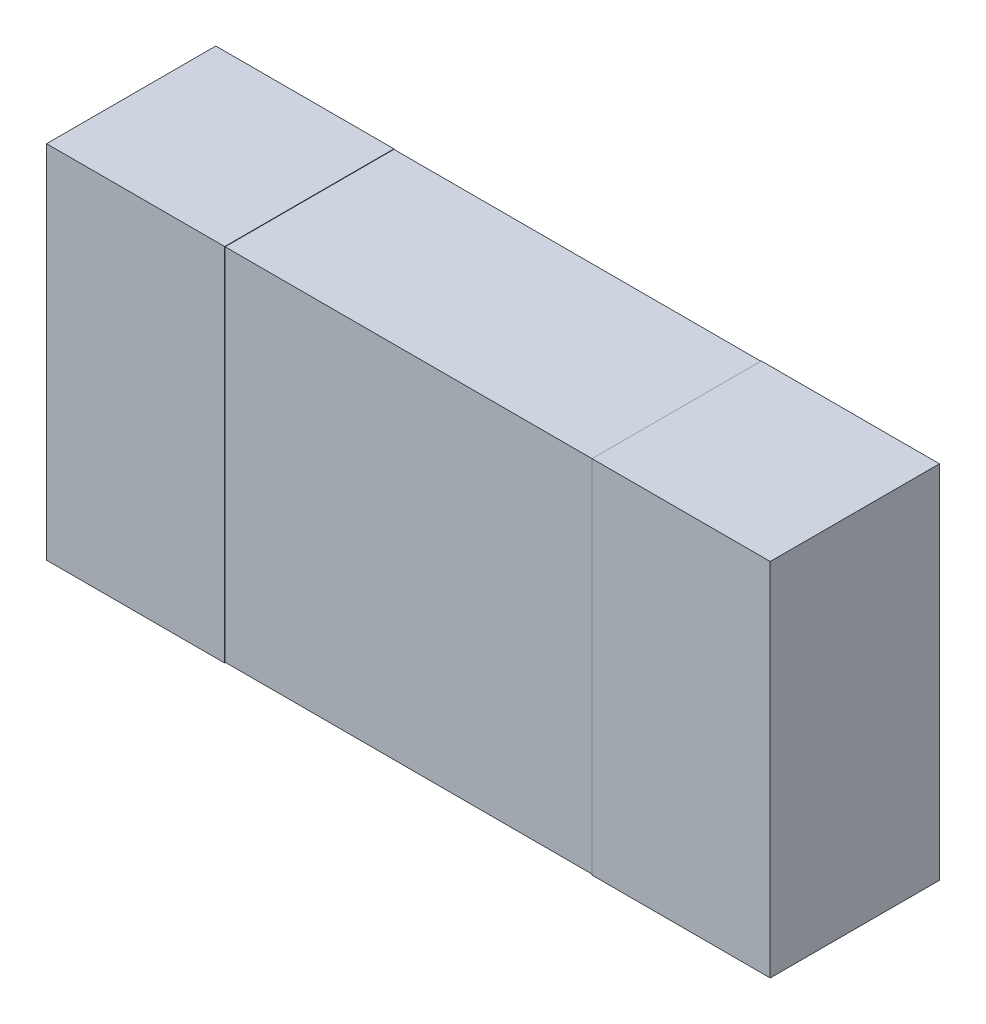
ISO-10303-21;
HEADER;
FILE_DESCRIPTION(('STEP AP214'),'2;1');
FILE_NAME('part.step','',(''),(''),'','','');
FILE_SCHEMA(('AUTOMOTIVE_DESIGN { 1 0 10303 214 1 1 1 1 }'));
ENDSEC;
DATA;
#1=APPLICATION_CONTEXT('core data for automotive mechanical design processes');
#2=APPLICATION_PROTOCOL_DEFINITION('international standard','automotive_design',2000,#1);
#3=PRODUCT_CONTEXT('',#1,'mechanical');
#4=PRODUCT('Part','Part','',(#3));
#5=PRODUCT_RELATED_PRODUCT_CATEGORY('part','',(#4));
#6=PRODUCT_DEFINITION_FORMATION('','',#4);
#7=PRODUCT_DEFINITION_CONTEXT('part definition',#1,'design');
#8=PRODUCT_DEFINITION('design','',#6,#7);
#9=PRODUCT_DEFINITION_SHAPE('','',#8);
#10=(LENGTH_UNIT() NAMED_UNIT(*) SI_UNIT(.MILLI.,.METRE.));
#11=(NAMED_UNIT(*) PLANE_ANGLE_UNIT() SI_UNIT($,.RADIAN.));
#12=(NAMED_UNIT(*) SI_UNIT($,.STERADIAN.) SOLID_ANGLE_UNIT());
#13=UNCERTAINTY_MEASURE_WITH_UNIT(LENGTH_MEASURE(1.E-05),#10,'distance_accuracy_value','');
#14=(GEOMETRIC_REPRESENTATION_CONTEXT(3) GLOBAL_UNCERTAINTY_ASSIGNED_CONTEXT((#13)) GLOBAL_UNIT_ASSIGNED_CONTEXT((#10,
#11,#12)) REPRESENTATION_CONTEXT('',''));
#15=CARTESIAN_POINT('',(0.,0.,0.));
#16=DIRECTION('',(0.,0.,1.));
#17=DIRECTION('',(1.,0.,0.));
#18=AXIS2_PLACEMENT_3D('',#15,#16,#17);
#19=CARTESIAN_POINT('',(0.,0.,0.38));
#20=DIRECTION('',(0.,0.,1.));
#21=DIRECTION('',(1.,0.,0.));
#22=AXIS2_PLACEMENT_3D('',#19,#20,#21);
#23=PLANE('',#22);
#24=DIRECTION('',(0.,-1.,0.));
#25=VECTOR('',#24,1.);
#26=CARTESIAN_POINT('',(0.8125,0.405,0.38));
#27=LINE('',#26,#25);
#28=CARTESIAN_POINT('',(0.8125,-0.405,0.38));
#29=VERTEX_POINT('',#28);
#30=CARTESIAN_POINT('',(0.8125,0.405,0.38));
#31=VERTEX_POINT('',#30);
#32=EDGE_CURVE('E223',#29,#31,#27,.F.);
#33=ORIENTED_EDGE('',*,*,#32,.T.);
#34=DIRECTION('',(1.,0.,0.));
#35=VECTOR('',#34,1.);
#36=CARTESIAN_POINT('',(-0.8125,0.405,0.38));
#37=LINE('',#36,#35);
#38=CARTESIAN_POINT('',(0.4125,0.405,0.38));
#39=VERTEX_POINT('',#38);
#40=EDGE_CURVE('E217',#31,#39,#37,.F.);
#41=ORIENTED_EDGE('',*,*,#40,.T.);
#42=DIRECTION('',(0.,1.,0.));
#43=VECTOR('',#42,1.);
#44=CARTESIAN_POINT('',(0.4125,0.405,0.38));
#45=LINE('',#44,#43);
#46=CARTESIAN_POINT('',(0.412499999999956,-0.405,0.38));
#47=VERTEX_POINT('',#46);
#48=EDGE_CURVE('E211',#39,#47,#45,.F.);
#49=ORIENTED_EDGE('',*,*,#48,.T.);
#50=DIRECTION('',(1.,0.,0.));
#51=VECTOR('',#50,1.);
#52=CARTESIAN_POINT('',(-0.8125,-0.405,0.38));
#53=LINE('',#52,#51);
#54=EDGE_CURVE('E93',#47,#29,#53,.T.);
#55=ORIENTED_EDGE('',*,*,#54,.T.);
#56=EDGE_LOOP('',(#33,#41,#49,#55));
#57=FACE_BOUND('',#56,.T.);
#58=ADVANCED_FACE('F16',(#57),#23,.T.);
#59=CARTESIAN_POINT('',(0.,0.,0.38));
#60=DIRECTION('',(0.,0.,1.));
#61=DIRECTION('',(1.,0.,0.));
#62=AXIS2_PLACEMENT_3D('',#59,#60,#61);
#63=PLANE('',#62);
#64=DIRECTION('',(1.,0.,0.));
#65=VECTOR('',#64,1.);
#66=CARTESIAN_POINT('',(-0.8125,0.405,0.38));
#67=LINE('',#66,#65);
#68=CARTESIAN_POINT('',(-0.4125,0.405,0.38));
#69=VERTEX_POINT('',#68);
#70=CARTESIAN_POINT('',(-0.8125,0.405,0.38));
#71=VERTEX_POINT('',#70);
#72=EDGE_CURVE('E107',#69,#71,#67,.F.);
#73=ORIENTED_EDGE('',*,*,#72,.T.);
#74=DIRECTION('',(0.,1.,0.));
#75=VECTOR('',#74,1.);
#76=CARTESIAN_POINT('',(-0.8125,0.405,0.38));
#77=LINE('',#76,#75);
#78=CARTESIAN_POINT('',(-0.8125,-0.405,0.38));
#79=VERTEX_POINT('',#78);
#80=EDGE_CURVE('E136',#71,#79,#77,.F.);
#81=ORIENTED_EDGE('',*,*,#80,.T.);
#82=DIRECTION('',(1.,0.,0.));
#83=VECTOR('',#82,1.);
#84=CARTESIAN_POINT('',(-0.8125,-0.405,0.38));
#85=LINE('',#84,#83);
#86=CARTESIAN_POINT('',(-0.4125,-0.405,0.38));
#87=VERTEX_POINT('',#86);
#88=EDGE_CURVE('E119',#79,#87,#85,.T.);
#89=ORIENTED_EDGE('',*,*,#88,.T.);
#90=DIRECTION('',(0.,1.,0.));
#91=VECTOR('',#90,1.);
#92=CARTESIAN_POINT('',(-0.4125,0.405,0.38));
#93=LINE('',#92,#91);
#94=EDGE_CURVE('E184',#87,#69,#93,.T.);
#95=ORIENTED_EDGE('',*,*,#94,.T.);
#96=EDGE_LOOP('',(#73,#81,#89,#95));
#97=FACE_BOUND('',#96,.T.);
#98=ADVANCED_FACE('F288',(#97),#63,.T.);
#99=CARTESIAN_POINT('',(0.4125,-0.405,0.379));
#100=DIRECTION('',(0.,0.,-1.));
#101=DIRECTION('',(-1.,0.,0.));
#102=AXIS2_PLACEMENT_3D('',#99,#100,#101);
#103=PLANE('',#102);
#104=DIRECTION('',(1.,0.,0.));
#105=VECTOR('',#104,1.);
#106=CARTESIAN_POINT('',(0.4125,0.404,0.379));
#107=LINE('',#106,#105);
#108=CARTESIAN_POINT('',(0.4125,0.404,0.379));
#109=VERTEX_POINT('',#108);
#110=CARTESIAN_POINT('',(-0.4125,0.404,0.379));
#111=VERTEX_POINT('',#110);
#112=EDGE_CURVE('E114',#109,#111,#107,.F.);
#113=ORIENTED_EDGE('',*,*,#112,.T.);
#114=DIRECTION('',(0.,1.,0.));
#115=VECTOR('',#114,1.);
#116=CARTESIAN_POINT('',(-0.4125,0.405,0.379));
#117=LINE('',#116,#115);
#118=CARTESIAN_POINT('',(-0.4125,-0.404,0.379));
#119=VERTEX_POINT('',#118);
#120=EDGE_CURVE('E190',#111,#119,#117,.F.);
#121=ORIENTED_EDGE('',*,*,#120,.T.);
#122=DIRECTION('',(1.,0.,0.));
#123=VECTOR('',#122,1.);
#124=CARTESIAN_POINT('',(0.4125,-0.404,0.379));
#125=LINE('',#124,#123);
#126=CARTESIAN_POINT('',(0.412499999999985,-0.404,0.379));
#127=VERTEX_POINT('',#126);
#128=EDGE_CURVE('E176',#119,#127,#125,.T.);
#129=ORIENTED_EDGE('',*,*,#128,.T.);
#130=DIRECTION('',(0.,1.,0.));
#131=VECTOR('',#130,1.);
#132=CARTESIAN_POINT('',(0.4125,0.405,0.379));
#133=LINE('',#132,#131);
#134=EDGE_CURVE('E68',#127,#109,#133,.T.);
#135=ORIENTED_EDGE('',*,*,#134,.T.);
#136=EDGE_LOOP('',(#113,#121,#129,#135));
#137=FACE_BOUND('',#136,.T.);
#138=ADVANCED_FACE('F293',(#137),#103,.F.);
#139=CARTESIAN_POINT('',(-0.8125,-0.405,0.38));
#140=DIRECTION('',(0.,1.,0.));
#141=DIRECTION('',(0.,0.,1.));
#142=AXIS2_PLACEMENT_3D('',#139,#140,#141);
#143=PLANE('',#142);
#144=DIRECTION('',(0.,0.,1.));
#145=VECTOR('',#144,1.);
#146=CARTESIAN_POINT('',(0.412499999999956,-0.405,0.38));
#147=LINE('',#146,#145);
#148=CARTESIAN_POINT('',(0.412499999999956,-0.405,0.));
#149=VERTEX_POINT('',#148);
#150=EDGE_CURVE('E209',#47,#149,#147,.F.);
#151=ORIENTED_EDGE('',*,*,#150,.T.);
#152=DIRECTION('',(1.,0.,0.));
#153=VECTOR('',#152,1.);
#154=CARTESIAN_POINT('',(0.,-0.405,0.));
#155=LINE('',#154,#153);
#156=CARTESIAN_POINT('',(0.8125,-0.405,0.));
#157=VERTEX_POINT('',#156);
#158=EDGE_CURVE('E170',#149,#157,#155,.T.);
#159=ORIENTED_EDGE('',*,*,#158,.T.);
#160=DIRECTION('',(0.,0.,1.));
#161=VECTOR('',#160,1.);
#162=CARTESIAN_POINT('',(0.8125,-0.405,0.38));
#163=LINE('',#162,#161);
#164=EDGE_CURVE('E230',#157,#29,#163,.T.);
#165=ORIENTED_EDGE('',*,*,#164,.T.);
#166=ORIENTED_EDGE('',*,*,#54,.F.);
#167=EDGE_LOOP('',(#151,#159,#165,#166));
#168=FACE_BOUND('',#167,.T.);
#169=ADVANCED_FACE('F285',(#168),#143,.F.);
#170=CARTESIAN_POINT('',(0.8125,0.405,0.38));
#171=DIRECTION('',(-1.,0.,0.));
#172=DIRECTION('',(0.,-1.,0.));
#173=AXIS2_PLACEMENT_3D('',#170,#171,#172);
#174=PLANE('',#173);
#175=DIRECTION('',(0.,0.,-1.));
#176=VECTOR('',#175,1.);
#177=CARTESIAN_POINT('',(0.8125,0.405,0.38));
#178=LINE('',#177,#176);
#179=CARTESIAN_POINT('',(0.8125,0.405,0.));
#180=VERTEX_POINT('',#179);
#181=EDGE_CURVE('E220',#180,#31,#178,.F.);
#182=ORIENTED_EDGE('',*,*,#181,.T.);
#183=ORIENTED_EDGE('',*,*,#32,.F.);
#184=ORIENTED_EDGE('',*,*,#164,.F.);
#185=DIRECTION('',(0.,1.,0.));
#186=VECTOR('',#185,1.);
#187=CARTESIAN_POINT('',(0.8125,0.,0.));
#188=LINE('',#187,#186);
#189=EDGE_CURVE('E167',#157,#180,#188,.T.);
#190=ORIENTED_EDGE('',*,*,#189,.T.);
#191=EDGE_LOOP('',(#182,#183,#184,#190));
#192=FACE_BOUND('',#191,.T.);
#193=ADVANCED_FACE('F284',(#192),#174,.F.);
#194=CARTESIAN_POINT('',(-0.8125,0.405,0.38));
#195=DIRECTION('',(0.,-1.,0.));
#196=DIRECTION('',(0.,0.,-1.));
#197=AXIS2_PLACEMENT_3D('',#194,#195,#196);
#198=PLANE('',#197);
#199=DIRECTION('',(0.,0.,1.));
#200=VECTOR('',#199,1.);
#201=CARTESIAN_POINT('',(0.4125,0.405,0.38));
#202=LINE('',#201,#200);
#203=CARTESIAN_POINT('',(0.4125,0.405,0.));
#204=VERTEX_POINT('',#203);
#205=EDGE_CURVE('E214',#204,#39,#202,.T.);
#206=ORIENTED_EDGE('',*,*,#205,.T.);
#207=ORIENTED_EDGE('',*,*,#40,.F.);
#208=ORIENTED_EDGE('',*,*,#181,.F.);
#209=DIRECTION('',(1.,0.,0.));
#210=VECTOR('',#209,1.);
#211=CARTESIAN_POINT('',(0.,0.405,0.));
#212=LINE('',#211,#210);
#213=EDGE_CURVE('E164',#180,#204,#212,.F.);
#214=ORIENTED_EDGE('',*,*,#213,.T.);
#215=EDGE_LOOP('',(#206,#207,#208,#214));
#216=FACE_BOUND('',#215,.T.);
#217=ADVANCED_FACE('F280',(#216),#198,.F.);
#218=CARTESIAN_POINT('',(0.4125,0.405,0.38));
#219=DIRECTION('',(1.,0.,0.));
#220=DIRECTION('',(0.,1.,0.));
#221=AXIS2_PLACEMENT_3D('',#218,#219,#220);
#222=PLANE('',#221);
#223=DIRECTION('',(0.,0.,1.));
#224=VECTOR('',#223,1.);
#225=CARTESIAN_POINT('',(0.4125,0.404,0.38));
#226=LINE('',#225,#224);
#227=CARTESIAN_POINT('',(0.4125,0.404,0.));
#228=VERTEX_POINT('',#227);
#229=EDGE_CURVE('E205',#228,#109,#226,.T.);
#230=ORIENTED_EDGE('',*,*,#229,.T.);
#231=ORIENTED_EDGE('',*,*,#134,.F.);
#232=DIRECTION('',(0.,0.,1.));
#233=VECTOR('',#232,1.);
#234=CARTESIAN_POINT('',(0.4125,-0.404,0.38));
#235=LINE('',#234,#233);
#236=CARTESIAN_POINT('',(0.412499999999978,-0.404,0.));
#237=VERTEX_POINT('',#236);
#238=EDGE_CURVE('E179',#127,#237,#235,.F.);
#239=ORIENTED_EDGE('',*,*,#238,.T.);
#240=DIRECTION('',(0.,1.,0.));
#241=VECTOR('',#240,1.);
#242=CARTESIAN_POINT('',(0.4125,0.405,0.));
#243=LINE('',#242,#241);
#244=EDGE_CURVE('E19',#237,#149,#243,.F.);
#245=ORIENTED_EDGE('',*,*,#244,.T.);
#246=ORIENTED_EDGE('',*,*,#150,.F.);
#247=ORIENTED_EDGE('',*,*,#48,.F.);
#248=ORIENTED_EDGE('',*,*,#205,.F.);
#249=DIRECTION('',(0.,1.,0.));
#250=VECTOR('',#249,1.);
#251=CARTESIAN_POINT('',(0.4125,0.405,0.));
#252=LINE('',#251,#250);
#253=EDGE_CURVE('E163',#204,#228,#252,.F.);
#254=ORIENTED_EDGE('',*,*,#253,.T.);
#255=EDGE_LOOP('',(#230,#231,#239,#245,#246,#247,#248,#254));
#256=FACE_BOUND('',#255,.T.);
#257=ADVANCED_FACE('F274',(#256),#222,.F.);
#258=CARTESIAN_POINT('',(0.4125,0.404,0.38));
#259=DIRECTION('',(0.,-1.,0.));
#260=DIRECTION('',(1.,0.,0.));
#261=AXIS2_PLACEMENT_3D('',#258,#259,#260);
#262=PLANE('',#261);
#263=ORIENTED_EDGE('',*,*,#112,.F.);
#264=ORIENTED_EDGE('',*,*,#229,.F.);
#265=DIRECTION('',(1.,0.,0.));
#266=VECTOR('',#265,1.);
#267=CARTESIAN_POINT('',(0.,0.404,0.));
#268=LINE('',#267,#266);
#269=CARTESIAN_POINT('',(-0.4125,0.404,0.));
#270=VERTEX_POINT('',#269);
#271=EDGE_CURVE('E153',#228,#270,#268,.F.);
#272=ORIENTED_EDGE('',*,*,#271,.T.);
#273=DIRECTION('',(0.,0.,1.));
#274=VECTOR('',#273,1.);
#275=CARTESIAN_POINT('',(-0.4125,0.404,0.38));
#276=LINE('',#275,#274);
#277=EDGE_CURVE('E193',#270,#111,#276,.T.);
#278=ORIENTED_EDGE('',*,*,#277,.T.);
#279=EDGE_LOOP('',(#263,#264,#272,#278));
#280=FACE_BOUND('',#279,.T.);
#281=ADVANCED_FACE('F313',(#280),#262,.F.);
#282=CARTESIAN_POINT('',(-0.8125,0.405,0.38));
#283=DIRECTION('',(0.,-1.,0.));
#284=DIRECTION('',(0.,0.,-1.));
#285=AXIS2_PLACEMENT_3D('',#282,#283,#284);
#286=PLANE('',#285);
#287=DIRECTION('',(0.,0.,1.));
#288=VECTOR('',#287,1.);
#289=CARTESIAN_POINT('',(-0.4125,0.405,0.38));
#290=LINE('',#289,#288);
#291=CARTESIAN_POINT('',(-0.4125,0.405,0.));
#292=VERTEX_POINT('',#291);
#293=EDGE_CURVE('E150',#69,#292,#290,.F.);
#294=ORIENTED_EDGE('',*,*,#293,.T.);
#295=DIRECTION('',(1.,0.,0.));
#296=VECTOR('',#295,1.);
#297=CARTESIAN_POINT('',(0.,0.405,0.));
#298=LINE('',#297,#296);
#299=CARTESIAN_POINT('',(-0.8125,0.405,0.));
#300=VERTEX_POINT('',#299);
#301=EDGE_CURVE('E144',#292,#300,#298,.F.);
#302=ORIENTED_EDGE('',*,*,#301,.T.);
#303=DIRECTION('',(0.,0.,1.));
#304=VECTOR('',#303,1.);
#305=CARTESIAN_POINT('',(-0.8125,0.405,0.38));
#306=LINE('',#305,#304);
#307=EDGE_CURVE('E132',#300,#71,#306,.T.);
#308=ORIENTED_EDGE('',*,*,#307,.T.);
#309=ORIENTED_EDGE('',*,*,#72,.F.);
#310=EDGE_LOOP('',(#294,#302,#308,#309));
#311=FACE_BOUND('',#310,.T.);
#312=ADVANCED_FACE('F148',(#311),#286,.F.);
#313=CARTESIAN_POINT('',(-0.8125,0.405,0.38));
#314=DIRECTION('',(1.,0.,0.));
#315=DIRECTION('',(0.,1.,0.));
#316=AXIS2_PLACEMENT_3D('',#313,#314,#315);
#317=PLANE('',#316);
#318=DIRECTION('',(0.,0.,1.));
#319=VECTOR('',#318,1.);
#320=CARTESIAN_POINT('',(-0.8125,-0.405,0.38));
#321=LINE('',#320,#319);
#322=CARTESIAN_POINT('',(-0.8125,-0.405,0.));
#323=VERTEX_POINT('',#322);
#324=EDGE_CURVE('E126',#323,#79,#321,.T.);
#325=ORIENTED_EDGE('',*,*,#324,.T.);
#326=ORIENTED_EDGE('',*,*,#80,.F.);
#327=ORIENTED_EDGE('',*,*,#307,.F.);
#328=DIRECTION('',(0.,1.,0.));
#329=VECTOR('',#328,1.);
#330=CARTESIAN_POINT('',(-0.8125,0.,0.));
#331=LINE('',#330,#329);
#332=EDGE_CURVE('E135',#300,#323,#331,.F.);
#333=ORIENTED_EDGE('',*,*,#332,.T.);
#334=EDGE_LOOP('',(#325,#326,#327,#333));
#335=FACE_BOUND('',#334,.T.);
#336=ADVANCED_FACE('F134',(#335),#317,.F.);
#337=CARTESIAN_POINT('',(-0.8125,-0.405,0.38));
#338=DIRECTION('',(0.,1.,0.));
#339=DIRECTION('',(0.,0.,1.));
#340=AXIS2_PLACEMENT_3D('',#337,#338,#339);
#341=PLANE('',#340);
#342=DIRECTION('',(0.,0.,1.));
#343=VECTOR('',#342,1.);
#344=CARTESIAN_POINT('',(-0.4125,-0.405,0.38));
#345=LINE('',#344,#343);
#346=CARTESIAN_POINT('',(-0.4125,-0.405,0.));
#347=VERTEX_POINT('',#346);
#348=EDGE_CURVE('E187',#347,#87,#345,.T.);
#349=ORIENTED_EDGE('',*,*,#348,.T.);
#350=ORIENTED_EDGE('',*,*,#88,.F.);
#351=ORIENTED_EDGE('',*,*,#324,.F.);
#352=DIRECTION('',(1.,0.,0.));
#353=VECTOR('',#352,1.);
#354=CARTESIAN_POINT('',(0.,-0.405,0.));
#355=LINE('',#354,#353);
#356=EDGE_CURVE('E146',#323,#347,#355,.T.);
#357=ORIENTED_EDGE('',*,*,#356,.T.);
#358=EDGE_LOOP('',(#349,#350,#351,#357));
#359=FACE_BOUND('',#358,.T.);
#360=ADVANCED_FACE('F305',(#359),#341,.F.);
#361=CARTESIAN_POINT('',(-0.4125,0.405,0.38));
#362=DIRECTION('',(-1.,0.,0.));
#363=DIRECTION('',(0.,0.,1.));
#364=AXIS2_PLACEMENT_3D('',#361,#362,#363);
#365=PLANE('',#364);
#366=ORIENTED_EDGE('',*,*,#293,.F.);
#367=ORIENTED_EDGE('',*,*,#94,.F.);
#368=ORIENTED_EDGE('',*,*,#348,.F.);
#369=DIRECTION('',(0.,1.,0.));
#370=VECTOR('',#369,1.);
#371=CARTESIAN_POINT('',(-0.4125,0.405,0.));
#372=LINE('',#371,#370);
#373=CARTESIAN_POINT('',(-0.4125,-0.404,0.));
#374=VERTEX_POINT('',#373);
#375=EDGE_CURVE('E25',#347,#374,#372,.T.);
#376=ORIENTED_EDGE('',*,*,#375,.T.);
#377=DIRECTION('',(0.,0.,1.));
#378=VECTOR('',#377,1.);
#379=CARTESIAN_POINT('',(-0.4125,-0.404,0.38));
#380=LINE('',#379,#378);
#381=EDGE_CURVE('E33',#374,#119,#380,.T.);
#382=ORIENTED_EDGE('',*,*,#381,.T.);
#383=ORIENTED_EDGE('',*,*,#120,.F.);
#384=ORIENTED_EDGE('',*,*,#277,.F.);
#385=DIRECTION('',(0.,1.,0.));
#386=VECTOR('',#385,1.);
#387=CARTESIAN_POINT('',(-0.4125,0.405,0.));
#388=LINE('',#387,#386);
#389=EDGE_CURVE('E151',#270,#292,#388,.T.);
#390=ORIENTED_EDGE('',*,*,#389,.T.);
#391=EDGE_LOOP('',(#366,#367,#368,#376,#382,#383,#384,#390));
#392=FACE_BOUND('',#391,.T.);
#393=ADVANCED_FACE('F300',(#392),#365,.F.);
#394=CARTESIAN_POINT('',(0.4125,-0.404,0.38));
#395=DIRECTION('',(0.,1.,0.));
#396=DIRECTION('',(0.,0.,1.));
#397=AXIS2_PLACEMENT_3D('',#394,#395,#396);
#398=PLANE('',#397);
#399=ORIENTED_EDGE('',*,*,#128,.F.);
#400=ORIENTED_EDGE('',*,*,#381,.F.);
#401=DIRECTION('',(1.,0.,0.));
#402=VECTOR('',#401,1.);
#403=CARTESIAN_POINT('',(0.,-0.404,0.));
#404=LINE('',#403,#402);
#405=EDGE_CURVE('E11',#374,#237,#404,.T.);
#406=ORIENTED_EDGE('',*,*,#405,.T.);
#407=ORIENTED_EDGE('',*,*,#238,.F.);
#408=EDGE_LOOP('',(#399,#400,#406,#407));
#409=FACE_BOUND('',#408,.T.);
#410=ADVANCED_FACE('F295',(#409),#398,.F.);
#411=CARTESIAN_POINT('',(0.,0.,0.));
#412=DIRECTION('',(0.,0.,1.));
#413=DIRECTION('',(1.,0.,0.));
#414=AXIS2_PLACEMENT_3D('',#411,#412,#413);
#415=PLANE('',#414);
#416=ORIENTED_EDGE('',*,*,#375,.F.);
#417=ORIENTED_EDGE('',*,*,#356,.F.);
#418=ORIENTED_EDGE('',*,*,#332,.F.);
#419=ORIENTED_EDGE('',*,*,#301,.F.);
#420=ORIENTED_EDGE('',*,*,#389,.F.);
#421=ORIENTED_EDGE('',*,*,#271,.F.);
#422=ORIENTED_EDGE('',*,*,#253,.F.);
#423=ORIENTED_EDGE('',*,*,#213,.F.);
#424=ORIENTED_EDGE('',*,*,#189,.F.);
#425=ORIENTED_EDGE('',*,*,#158,.F.);
#426=ORIENTED_EDGE('',*,*,#244,.F.);
#427=ORIENTED_EDGE('',*,*,#405,.F.);
#428=EDGE_LOOP('',(#416,#417,#418,#419,#420,#421,#422,#423,#424,#425,#426,#427));
#429=FACE_BOUND('',#428,.T.);
#430=ADVANCED_FACE('F142',(#429),#415,.F.);
#431=CLOSED_SHELL('',(#58,#98,#138,#169,#193,#217,#257,#281,#312,#336,#360,#393,#410,#430));
#432=MANIFOLD_SOLID_BREP('B1',#431);
#433=ADVANCED_BREP_SHAPE_REPRESENTATION('',(#18,#432),#14);
#434=SHAPE_DEFINITION_REPRESENTATION(#9,#433);
ENDSEC;
END-ISO-10303-21;
